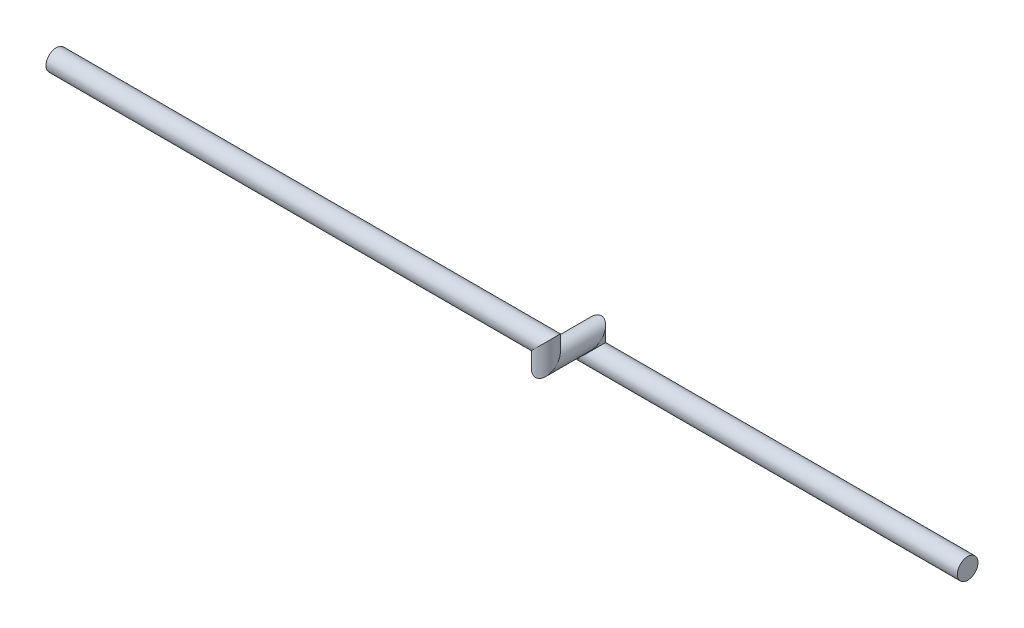
ISO-10303-21;
HEADER;
FILE_DESCRIPTION(('STEP AP214'),'2;1');
FILE_NAME('part.step','',(''),(''),'','','');
FILE_SCHEMA(('AUTOMOTIVE_DESIGN { 1 0 10303 214 1 1 1 1 }'));
ENDSEC;
DATA;
#1=APPLICATION_CONTEXT('core data for automotive mechanical design processes');
#2=APPLICATION_PROTOCOL_DEFINITION('international standard','automotive_design',2000,#1);
#3=PRODUCT_CONTEXT('',#1,'mechanical');
#4=PRODUCT('Part','Part','',(#3));
#5=PRODUCT_RELATED_PRODUCT_CATEGORY('part','',(#4));
#6=PRODUCT_DEFINITION_FORMATION('','',#4);
#7=PRODUCT_DEFINITION_CONTEXT('part definition',#1,'design');
#8=PRODUCT_DEFINITION('design','',#6,#7);
#9=PRODUCT_DEFINITION_SHAPE('','',#8);
#10=(LENGTH_UNIT() NAMED_UNIT(*) SI_UNIT(.MILLI.,.METRE.));
#11=(NAMED_UNIT(*) PLANE_ANGLE_UNIT() SI_UNIT($,.RADIAN.));
#12=(NAMED_UNIT(*) SI_UNIT($,.STERADIAN.) SOLID_ANGLE_UNIT());
#13=UNCERTAINTY_MEASURE_WITH_UNIT(LENGTH_MEASURE(1.E-05),#10,'distance_accuracy_value','');
#14=(GEOMETRIC_REPRESENTATION_CONTEXT(3) GLOBAL_UNCERTAINTY_ASSIGNED_CONTEXT((#13)) GLOBAL_UNIT_ASSIGNED_CONTEXT((#10,
#11,#12)) REPRESENTATION_CONTEXT('',''));
#15=CARTESIAN_POINT('',(0.,0.,0.));
#16=DIRECTION('',(0.,0.,1.));
#17=DIRECTION('',(1.,0.,0.));
#18=AXIS2_PLACEMENT_3D('',#15,#16,#17);
#19=CARTESIAN_POINT('',(-1150.,40.,60.));
#20=DIRECTION('',(1.,0.,0.));
#21=DIRECTION('',(0.,0.,-1.));
#22=AXIS2_PLACEMENT_3D('',#19,#20,#21);
#23=PLANE('',#22);
#24=CARTESIAN_POINT('',(-1150.,40.,60.));
#25=DIRECTION('',(1.,0.,0.));
#26=DIRECTION('',(0.,0.,-1.));
#27=AXIS2_PLACEMENT_3D('',#24,#25,#26);
#28=CIRCLE('',#27,13.7);
#29=CARTESIAN_POINT('',(-1150.,40.,46.3));
#30=VERTEX_POINT('',#29);
#31=EDGE_CURVE('E38',#30,#30,#28,.T.);
#32=ORIENTED_EDGE('',*,*,#31,.F.);
#33=EDGE_LOOP('',(#32));
#34=FACE_BOUND('',#33,.T.);
#35=ADVANCED_FACE('F35',(#34),#23,.F.);
#36=CARTESIAN_POINT('',(0.,0.,0.));
#37=DIRECTION('',(1.,0.,0.));
#38=DIRECTION('',(0.,0.,-1.));
#39=AXIS2_PLACEMENT_3D('',#36,#37,#38);
#40=PLANE('',#39);
#41=CARTESIAN_POINT('',(0.,0.,0.));
#42=DIRECTION('',(1.,0.,0.));
#43=DIRECTION('',(0.,0.,-1.));
#44=AXIS2_PLACEMENT_3D('',#41,#42,#43);
#45=CIRCLE('',#44,13.7);
#46=CARTESIAN_POINT('',(0.,0.,-13.7));
#47=VERTEX_POINT('',#46);
#48=EDGE_CURVE('E43',#47,#47,#45,.T.);
#49=ORIENTED_EDGE('',*,*,#48,.T.);
#50=EDGE_LOOP('',(#49));
#51=FACE_BOUND('',#50,.T.);
#52=ADVANCED_FACE('F86',(#51),#40,.T.);
#53=CARTESIAN_POINT('',(-469.76,40.,60.));
#54=DIRECTION('',(-1.,0.,0.));
#55=DIRECTION('',(0.,0.,1.));
#56=AXIS2_PLACEMENT_3D('',#53,#54,#55);
#57=CYLINDRICAL_SURFACE('',#56,13.7);
#58=CARTESIAN_POINT('',(-500.,40.,60.));
#59=DIRECTION('',(-0.707106781186548,0.707106781186548,0.));
#60=DIRECTION('',(0.707106781186548,0.707106781186548,0.));
#61=AXIS2_PLACEMENT_3D('',#58,#59,#60);
#62=ELLIPSE('',#61,19.3747258045114,13.7);
#63=CARTESIAN_POINT('',(-486.3,53.7,60.));
#64=VERTEX_POINT('',#63);
#65=EDGE_CURVE('E53',#64,#64,#62,.T.);
#66=ORIENTED_EDGE('',*,*,#65,.T.);
#67=EDGE_LOOP('',(#66));
#68=FACE_BOUND('',#67,.T.);
#69=ORIENTED_EDGE('',*,*,#31,.T.);
#70=EDGE_LOOP('',(#69));
#71=FACE_BOUND('',#70,.T.);
#72=ADVANCED_FACE('F83',(#68,#71),#57,.T.);
#73=CARTESIAN_POINT('',(-500.,4.83,60.));
#74=DIRECTION('',(0.,1.,0.));
#75=DIRECTION('',(0.,0.,1.));
#76=AXIS2_PLACEMENT_3D('',#73,#74,#75);
#77=CYLINDRICAL_SURFACE('',#76,13.7);
#78=CARTESIAN_POINT('',(-500.,20.,60.));
#79=DIRECTION('',(0.,0.707106781186547,0.707106781186547));
#80=DIRECTION('',(0.,-0.707106781186548,0.707106781186548));
#81=AXIS2_PLACEMENT_3D('',#78,#79,#80);
#82=ELLIPSE('',#81,19.3747258045114,13.7);
#83=CARTESIAN_POINT('',(-500.,6.29999999999999,73.7));
#84=VERTEX_POINT('',#83);
#85=EDGE_CURVE('E76',#84,#84,#82,.T.);
#86=ORIENTED_EDGE('',*,*,#85,.T.);
#87=EDGE_LOOP('',(#86));
#88=FACE_BOUND('',#87,.T.);
#89=ORIENTED_EDGE('',*,*,#65,.F.);
#90=EDGE_LOOP('',(#89));
#91=FACE_BOUND('',#90,.T.);
#92=ADVANCED_FACE('F85',(#88,#91),#77,.T.);
#93=CARTESIAN_POINT('',(-500.,20.,-15.17));
#94=DIRECTION('',(0.,0.,1.));
#95=DIRECTION('',(1.,0.,0.));
#96=AXIS2_PLACEMENT_3D('',#93,#94,#95);
#97=CYLINDRICAL_SURFACE('',#96,13.7);
#98=CARTESIAN_POINT('',(-500.,20.,0.));
#99=DIRECTION('',(0.,0.707106781186547,0.707106781186547));
#100=DIRECTION('',(0.,0.707106781186548,-0.707106781186548));
#101=AXIS2_PLACEMENT_3D('',#98,#99,#100);
#102=ELLIPSE('',#101,19.3747258045114,13.7);
#103=CARTESIAN_POINT('',(-500.,33.7,-13.7));
#104=VERTEX_POINT('',#103);
#105=EDGE_CURVE('E74',#104,#104,#102,.T.);
#106=ORIENTED_EDGE('',*,*,#105,.T.);
#107=EDGE_LOOP('',(#106));
#108=FACE_BOUND('',#107,.T.);
#109=ORIENTED_EDGE('',*,*,#85,.F.);
#110=EDGE_LOOP('',(#109));
#111=FACE_BOUND('',#110,.T.);
#112=ADVANCED_FACE('F71',(#108,#111),#97,.T.);
#113=CARTESIAN_POINT('',(-500.,-30.24,0.));
#114=DIRECTION('',(0.,1.,0.));
#115=DIRECTION('',(0.,0.,1.));
#116=AXIS2_PLACEMENT_3D('',#113,#114,#115);
#117=CYLINDRICAL_SURFACE('',#116,13.7);
#118=CARTESIAN_POINT('',(-500.,0.,0.));
#119=DIRECTION('',(-0.707106781186547,0.707106781186547,0.));
#120=DIRECTION('',(-0.707106781186548,-0.707106781186548,0.));
#121=AXIS2_PLACEMENT_3D('',#118,#119,#120);
#122=ELLIPSE('',#121,19.3747258045114,13.7);
#123=CARTESIAN_POINT('',(-513.7,-13.7,0.));
#124=VERTEX_POINT('',#123);
#125=EDGE_CURVE('E11',#124,#124,#122,.T.);
#126=ORIENTED_EDGE('',*,*,#125,.T.);
#127=EDGE_LOOP('',(#126));
#128=FACE_BOUND('',#127,.T.);
#129=ORIENTED_EDGE('',*,*,#105,.F.);
#130=EDGE_LOOP('',(#129));
#131=FACE_BOUND('',#130,.T.);
#132=ADVANCED_FACE('F68',(#128,#131),#117,.T.);
#133=CARTESIAN_POINT('',(0.,0.,0.));
#134=DIRECTION('',(-1.,0.,0.));
#135=DIRECTION('',(0.,0.,1.));
#136=AXIS2_PLACEMENT_3D('',#133,#134,#135);
#137=CYLINDRICAL_SURFACE('',#136,13.7);
#138=ORIENTED_EDGE('',*,*,#48,.F.);
#139=EDGE_LOOP('',(#138));
#140=FACE_BOUND('',#139,.T.);
#141=ORIENTED_EDGE('',*,*,#125,.F.);
#142=EDGE_LOOP('',(#141));
#143=FACE_BOUND('',#142,.T.);
#144=ADVANCED_FACE('F66',(#140,#143),#137,.T.);
#145=CLOSED_SHELL('',(#35,#52,#72,#92,#112,#132,#144));
#146=MANIFOLD_SOLID_BREP('B2',#145);
#147=ADVANCED_BREP_SHAPE_REPRESENTATION('',(#18,#146),#14);
#148=SHAPE_DEFINITION_REPRESENTATION(#9,#147);
ENDSEC;
END-ISO-10303-21;
